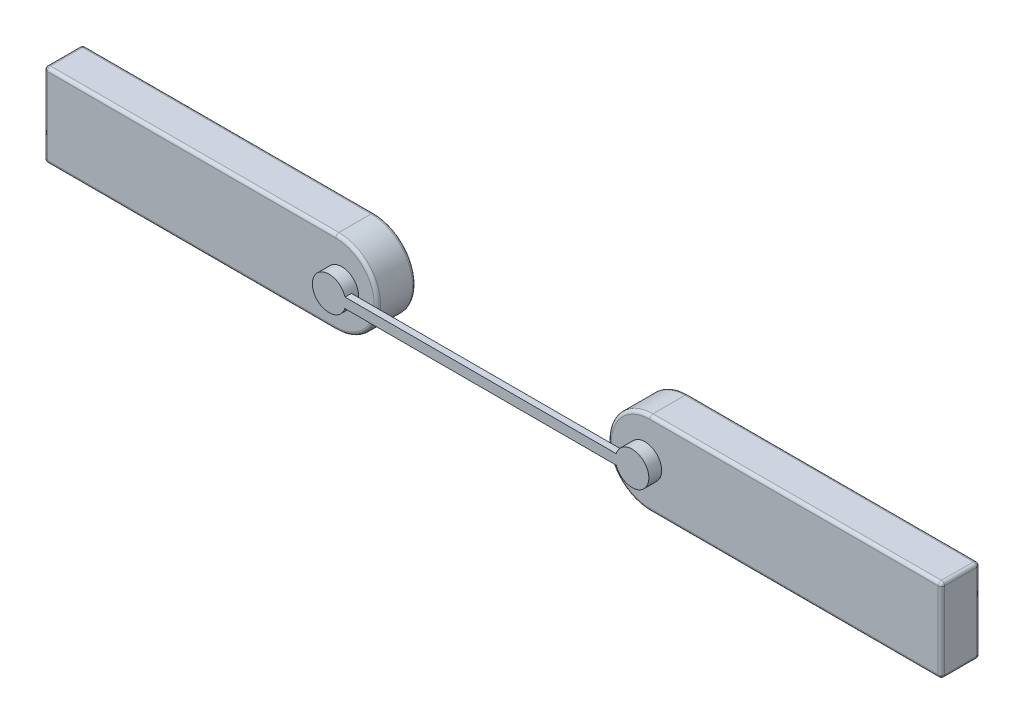
ISO-10303-21;
HEADER;
FILE_DESCRIPTION(('STEP AP214'),'2;1');
FILE_NAME('part.step','',(''),(''),'','','');
FILE_SCHEMA(('AUTOMOTIVE_DESIGN { 1 0 10303 214 1 1 1 1 }'));
ENDSEC;
DATA;
#1=APPLICATION_CONTEXT('core data for automotive mechanical design processes');
#2=APPLICATION_PROTOCOL_DEFINITION('international standard','automotive_design',2000,#1);
#3=PRODUCT_CONTEXT('',#1,'mechanical');
#4=PRODUCT('Part','Part','',(#3));
#5=PRODUCT_RELATED_PRODUCT_CATEGORY('part','',(#4));
#6=PRODUCT_DEFINITION_FORMATION('','',#4);
#7=PRODUCT_DEFINITION_CONTEXT('part definition',#1,'design');
#8=PRODUCT_DEFINITION('design','',#6,#7);
#9=PRODUCT_DEFINITION_SHAPE('','',#8);
#10=(LENGTH_UNIT() NAMED_UNIT(*) SI_UNIT(.MILLI.,.METRE.));
#11=(NAMED_UNIT(*) PLANE_ANGLE_UNIT() SI_UNIT($,.RADIAN.));
#12=(NAMED_UNIT(*) SI_UNIT($,.STERADIAN.) SOLID_ANGLE_UNIT());
#13=UNCERTAINTY_MEASURE_WITH_UNIT(LENGTH_MEASURE(1.E-05),#10,'distance_accuracy_value','');
#14=(GEOMETRIC_REPRESENTATION_CONTEXT(3) GLOBAL_UNCERTAINTY_ASSIGNED_CONTEXT((#13)) GLOBAL_UNIT_ASSIGNED_CONTEXT((#10,
#11,#12)) REPRESENTATION_CONTEXT('',''));
#15=CARTESIAN_POINT('',(0.,0.,0.));
#16=DIRECTION('',(0.,0.,1.));
#17=DIRECTION('',(1.,0.,0.));
#18=AXIS2_PLACEMENT_3D('',#15,#16,#17);
#19=CARTESIAN_POINT('',(3.475,-0.299999999999999,0.025));
#20=DIRECTION('',(1.,0.,0.));
#21=DIRECTION('',(0.,-1.,0.));
#22=AXIS2_PLACEMENT_3D('',#19,#20,#21);
#23=SPHERICAL_SURFACE('',#22,0.0250000000000006);
#24=CARTESIAN_POINT('',(3.475,-0.3,0.025));
#25=DIRECTION('',(1.,0.,0.));
#26=DIRECTION('',(0.,1.,0.));
#27=AXIS2_PLACEMENT_3D('',#24,#25,#26);
#28=CIRCLE('',#27,0.025);
#29=CARTESIAN_POINT('',(3.475,-0.3,0.));
#30=VERTEX_POINT('',#29);
#31=CARTESIAN_POINT('',(3.475,-0.325,0.025));
#32=VERTEX_POINT('',#31);
#33=EDGE_CURVE('E191',#30,#32,#28,.F.);
#34=ORIENTED_EDGE('',*,*,#33,.F.);
#35=CARTESIAN_POINT('',(3.475,-0.3,0.025));
#36=DIRECTION('',(0.,1.,0.));
#37=DIRECTION('',(0.,0.,1.));
#38=AXIS2_PLACEMENT_3D('',#35,#36,#37);
#39=CIRCLE('',#38,0.025);
#40=CARTESIAN_POINT('',(3.5,-0.3,0.025));
#41=VERTEX_POINT('',#40);
#42=EDGE_CURVE('E228',#41,#30,#39,.T.);
#43=ORIENTED_EDGE('',*,*,#42,.F.);
#44=CARTESIAN_POINT('',(3.475,-0.3,0.025));
#45=DIRECTION('',(0.,0.,-1.));
#46=DIRECTION('',(-1.,0.,0.));
#47=AXIS2_PLACEMENT_3D('',#44,#45,#46);
#48=CIRCLE('',#47,0.0249999999999998);
#49=EDGE_CURVE('E226',#32,#41,#48,.F.);
#50=ORIENTED_EDGE('',*,*,#49,.F.);
#51=EDGE_LOOP('',(#34,#43,#50));
#52=FACE_BOUND('',#51,.T.);
#53=ADVANCED_FACE('F16',(#52),#23,.T.);
#54=CARTESIAN_POINT('',(2.26404410227311,0.,0.));
#55=DIRECTION('',(0.,0.,1.));
#56=DIRECTION('',(1.,0.,0.));
#57=AXIS2_PLACEMENT_3D('',#54,#55,#56);
#58=PLANE('',#57);
#59=DIRECTION('',(0.,1.,0.));
#60=VECTOR('',#59,1.);
#61=CARTESIAN_POINT('',(3.475,0.0812500000000004,0.));
#62=LINE('',#61,#60);
#63=CARTESIAN_POINT('',(3.475,0.3,0.));
#64=VERTEX_POINT('',#63);
#65=EDGE_CURVE('E188',#30,#64,#62,.T.);
#66=ORIENTED_EDGE('',*,*,#65,.F.);
#67=DIRECTION('',(1.,0.,0.));
#68=VECTOR('',#67,1.);
#69=CARTESIAN_POINT('',(2.31327205113655,-0.3,0.));
#70=LINE('',#69,#68);
#71=CARTESIAN_POINT('',(1.225,-0.3,0.));
#72=VERTEX_POINT('',#71);
#73=EDGE_CURVE('E185',#72,#30,#70,.T.);
#74=ORIENTED_EDGE('',*,*,#73,.F.);
#75=CARTESIAN_POINT('',(1.225,0.,0.));
#76=DIRECTION('',(0.,0.,1.));
#77=DIRECTION('',(1.,0.,0.));
#78=AXIS2_PLACEMENT_3D('',#75,#76,#77);
#79=CIRCLE('',#78,0.3);
#80=CARTESIAN_POINT('',(1.225,0.3,0.));
#81=VERTEX_POINT('',#80);
#82=EDGE_CURVE('E20',#81,#72,#79,.T.);
#83=ORIENTED_EDGE('',*,*,#82,.F.);
#84=DIRECTION('',(-1.,0.,0.));
#85=VECTOR('',#84,1.);
#86=CARTESIAN_POINT('',(2.31327205113655,0.3,0.));
#87=LINE('',#86,#85);
#88=EDGE_CURVE('E201',#64,#81,#87,.T.);
#89=ORIENTED_EDGE('',*,*,#88,.F.);
#90=EDGE_LOOP('',(#66,#74,#83,#89));
#91=FACE_BOUND('',#90,.T.);
#92=ADVANCED_FACE('F187',(#91),#58,.F.);
#93=CARTESIAN_POINT('',(3.475,0.3,0.0250000000000007));
#94=DIRECTION('',(1.,0.,0.));
#95=DIRECTION('',(0.,0.,-1.));
#96=AXIS2_PLACEMENT_3D('',#93,#94,#95);
#97=SPHERICAL_SURFACE('',#96,0.0250000000000003);
#98=CARTESIAN_POINT('',(3.475,0.3,0.025));
#99=DIRECTION('',(0.,1.,0.));
#100=DIRECTION('',(0.,0.,1.));
#101=AXIS2_PLACEMENT_3D('',#98,#99,#100);
#102=CIRCLE('',#101,0.025);
#103=CARTESIAN_POINT('',(3.5,0.3,0.025));
#104=VERTEX_POINT('',#103);
#105=EDGE_CURVE('E223',#64,#104,#102,.F.);
#106=ORIENTED_EDGE('',*,*,#105,.F.);
#107=CARTESIAN_POINT('',(3.475,0.3,0.025));
#108=DIRECTION('',(-1.,0.,0.));
#109=DIRECTION('',(0.,-1.,0.));
#110=AXIS2_PLACEMENT_3D('',#107,#108,#109);
#111=CIRCLE('',#110,0.025);
#112=CARTESIAN_POINT('',(3.475,0.325,0.025));
#113=VERTEX_POINT('',#112);
#114=EDGE_CURVE('E220',#113,#64,#111,.T.);
#115=ORIENTED_EDGE('',*,*,#114,.F.);
#116=CARTESIAN_POINT('',(3.475,0.3,0.025));
#117=DIRECTION('',(0.,0.,-1.));
#118=DIRECTION('',(-1.,0.,0.));
#119=AXIS2_PLACEMENT_3D('',#116,#117,#118);
#120=CIRCLE('',#119,0.0249999999999998);
#121=EDGE_CURVE('E198',#104,#113,#120,.F.);
#122=ORIENTED_EDGE('',*,*,#121,.F.);
#123=EDGE_LOOP('',(#106,#115,#122));
#124=FACE_BOUND('',#123,.T.);
#125=ADVANCED_FACE('F402',(#124),#97,.T.);
#126=CARTESIAN_POINT('',(2.31327205113655,-0.3,0.025));
#127=DIRECTION('',(1.,0.,0.));
#128=DIRECTION('',(0.,1.,0.));
#129=AXIS2_PLACEMENT_3D('',#126,#127,#128);
#130=CYLINDRICAL_SURFACE('',#129,0.025);
#131=ORIENTED_EDGE('',*,*,#33,.T.);
#132=DIRECTION('',(1.,0.,0.));
#133=VECTOR('',#132,1.);
#134=CARTESIAN_POINT('',(2.3625,-0.325,0.025));
#135=LINE('',#134,#133);
#136=CARTESIAN_POINT('',(1.225,-0.325,0.025));
#137=VERTEX_POINT('',#136);
#138=EDGE_CURVE('E196',#137,#32,#135,.T.);
#139=ORIENTED_EDGE('',*,*,#138,.F.);
#140=CARTESIAN_POINT('',(1.225,-0.3,0.0250000000000002));
#141=DIRECTION('',(-1.,0.,0.));
#142=DIRECTION('',(0.,0.,1.));
#143=AXIS2_PLACEMENT_3D('',#140,#141,#142);
#144=CIRCLE('',#143,0.0250000000000001);
#145=EDGE_CURVE('E181',#72,#137,#144,.T.);
#146=ORIENTED_EDGE('',*,*,#145,.F.);
#147=ORIENTED_EDGE('',*,*,#73,.T.);
#148=EDGE_LOOP('',(#131,#139,#146,#147));
#149=FACE_BOUND('',#148,.T.);
#150=ADVANCED_FACE('F194',(#149),#130,.T.);
#151=CARTESIAN_POINT('',(3.475,-0.3,0.3));
#152=DIRECTION('',(0.,0.,-1.));
#153=DIRECTION('',(-1.,0.,0.));
#154=AXIS2_PLACEMENT_3D('',#151,#152,#153);
#155=CYLINDRICAL_SURFACE('',#154,0.0249999999999998);
#156=ORIENTED_EDGE('',*,*,#49,.T.);
#157=DIRECTION('',(0.,0.,-1.));
#158=VECTOR('',#157,1.);
#159=CARTESIAN_POINT('',(3.5,-0.3,0.3));
#160=LINE('',#159,#158);
#161=CARTESIAN_POINT('',(3.5,-0.300000000000008,0.275));
#162=VERTEX_POINT('',#161);
#163=EDGE_CURVE('E237',#162,#41,#160,.T.);
#164=ORIENTED_EDGE('',*,*,#163,.F.);
#165=CARTESIAN_POINT('',(3.475,-0.299999999999999,0.275));
#166=DIRECTION('',(0.,0.,1.));
#167=DIRECTION('',(0.,-1.,0.));
#168=AXIS2_PLACEMENT_3D('',#165,#166,#167);
#169=CIRCLE('',#168,0.0250000000000003);
#170=CARTESIAN_POINT('',(3.475,-0.325,0.275));
#171=VERTEX_POINT('',#170);
#172=EDGE_CURVE('E371',#171,#162,#169,.T.);
#173=ORIENTED_EDGE('',*,*,#172,.F.);
#174=DIRECTION('',(0.,0.,1.));
#175=VECTOR('',#174,1.);
#176=CARTESIAN_POINT('',(3.475,-0.325,0.3));
#177=LINE('',#176,#175);
#178=EDGE_CURVE('E379',#32,#171,#177,.T.);
#179=ORIENTED_EDGE('',*,*,#178,.F.);
#180=EDGE_LOOP('',(#156,#164,#173,#179));
#181=FACE_BOUND('',#180,.T.);
#182=ADVANCED_FACE('F776',(#181),#155,.T.);
#183=CARTESIAN_POINT('',(3.475,0.0812500000000004,0.025));
#184=DIRECTION('',(0.,1.,0.));
#185=DIRECTION('',(0.,0.,1.));
#186=AXIS2_PLACEMENT_3D('',#183,#184,#185);
#187=CYLINDRICAL_SURFACE('',#186,0.025);
#188=ORIENTED_EDGE('',*,*,#105,.T.);
#189=DIRECTION('',(0.,1.,0.));
#190=VECTOR('',#189,1.);
#191=CARTESIAN_POINT('',(3.5,0.1625,0.025));
#192=LINE('',#191,#190);
#193=EDGE_CURVE('E234',#41,#104,#192,.T.);
#194=ORIENTED_EDGE('',*,*,#193,.F.);
#195=ORIENTED_EDGE('',*,*,#42,.T.);
#196=ORIENTED_EDGE('',*,*,#65,.T.);
#197=EDGE_LOOP('',(#188,#194,#195,#196));
#198=FACE_BOUND('',#197,.T.);
#199=ADVANCED_FACE('F405',(#198),#187,.T.);
#200=CARTESIAN_POINT('',(2.31327205113655,0.3,0.025));
#201=DIRECTION('',(-1.,0.,0.));
#202=DIRECTION('',(0.,-1.,0.));
#203=AXIS2_PLACEMENT_3D('',#200,#201,#202);
#204=CYLINDRICAL_SURFACE('',#203,0.025);
#205=CARTESIAN_POINT('',(1.225,0.3,0.025));
#206=DIRECTION('',(-1.,0.,0.));
#207=DIRECTION('',(0.,0.,1.));
#208=AXIS2_PLACEMENT_3D('',#205,#206,#207);
#209=CIRCLE('',#208,0.025);
#210=CARTESIAN_POINT('',(1.225,0.325,0.025));
#211=VERTEX_POINT('',#210);
#212=EDGE_CURVE('E184',#211,#81,#209,.T.);
#213=ORIENTED_EDGE('',*,*,#212,.F.);
#214=DIRECTION('',(-1.,0.,0.));
#215=VECTOR('',#214,1.);
#216=CARTESIAN_POINT('',(2.3625,0.325,0.025));
#217=LINE('',#216,#215);
#218=EDGE_CURVE('E211',#113,#211,#217,.T.);
#219=ORIENTED_EDGE('',*,*,#218,.F.);
#220=ORIENTED_EDGE('',*,*,#114,.T.);
#221=ORIENTED_EDGE('',*,*,#88,.T.);
#222=EDGE_LOOP('',(#213,#219,#220,#221));
#223=FACE_BOUND('',#222,.T.);
#224=ADVANCED_FACE('F397',(#223),#204,.T.);
#225=CARTESIAN_POINT('',(3.475,0.3,0.3));
#226=DIRECTION('',(0.,0.,-1.));
#227=DIRECTION('',(-1.,0.,0.));
#228=AXIS2_PLACEMENT_3D('',#225,#226,#227);
#229=CYLINDRICAL_SURFACE('',#228,0.0249999999999998);
#230=ORIENTED_EDGE('',*,*,#121,.T.);
#231=DIRECTION('',(0.,0.,1.));
#232=VECTOR('',#231,1.);
#233=CARTESIAN_POINT('',(3.475,0.325,0.3));
#234=LINE('',#233,#232);
#235=CARTESIAN_POINT('',(3.475,0.325,0.275));
#236=VERTEX_POINT('',#235);
#237=EDGE_CURVE('E214',#236,#113,#234,.F.);
#238=ORIENTED_EDGE('',*,*,#237,.F.);
#239=CARTESIAN_POINT('',(3.475,0.299999999999999,0.275));
#240=DIRECTION('',(0.,0.,1.));
#241=DIRECTION('',(1.,0.,0.));
#242=AXIS2_PLACEMENT_3D('',#239,#240,#241);
#243=CIRCLE('',#242,0.0250000000000006);
#244=CARTESIAN_POINT('',(3.5,0.3,0.275));
#245=VERTEX_POINT('',#244);
#246=EDGE_CURVE('E215',#245,#236,#243,.T.);
#247=ORIENTED_EDGE('',*,*,#246,.F.);
#248=DIRECTION('',(0.,0.,-1.));
#249=VECTOR('',#248,1.);
#250=CARTESIAN_POINT('',(3.5,0.3,0.3));
#251=LINE('',#250,#249);
#252=EDGE_CURVE('E369',#104,#245,#251,.F.);
#253=ORIENTED_EDGE('',*,*,#252,.F.);
#254=EDGE_LOOP('',(#230,#238,#247,#253));
#255=FACE_BOUND('',#254,.T.);
#256=ADVANCED_FACE('F767',(#255),#229,.T.);
#257=CARTESIAN_POINT('',(1.225,0.,0.025));
#258=DIRECTION('',(0.,0.,1.));
#259=DIRECTION('',(1.,0.,0.));
#260=AXIS2_PLACEMENT_3D('',#257,#258,#259);
#261=TOROIDAL_SURFACE('',#260,0.3,0.025);
#262=ORIENTED_EDGE('',*,*,#212,.T.);
#263=ORIENTED_EDGE('',*,*,#82,.T.);
#264=ORIENTED_EDGE('',*,*,#145,.T.);
#265=CARTESIAN_POINT('',(1.225,0.,0.025));
#266=DIRECTION('',(0.,0.,-1.));
#267=DIRECTION('',(-1.,0.,0.));
#268=AXIS2_PLACEMENT_3D('',#265,#266,#267);
#269=CIRCLE('',#268,0.325);
#270=EDGE_CURVE('E344',#211,#137,#269,.F.);
#271=ORIENTED_EDGE('',*,*,#270,.F.);
#272=EDGE_LOOP('',(#262,#263,#264,#271));
#273=FACE_BOUND('',#272,.T.);
#274=ADVANCED_FACE('F179',(#273),#261,.T.);
#275=CARTESIAN_POINT('',(2.3625,-0.325,0.3));
#276=DIRECTION('',(0.,-1.,0.));
#277=DIRECTION('',(1.,0.,0.));
#278=AXIS2_PLACEMENT_3D('',#275,#276,#277);
#279=PLANE('',#278);
#280=DIRECTION('',(1.,0.,0.));
#281=VECTOR('',#280,1.);
#282=CARTESIAN_POINT('',(2.31327205113655,-0.325,0.275));
#283=LINE('',#282,#281);
#284=CARTESIAN_POINT('',(1.225,-0.325,0.275));
#285=VERTEX_POINT('',#284);
#286=EDGE_CURVE('E329',#285,#171,#283,.T.);
#287=ORIENTED_EDGE('',*,*,#286,.F.);
#288=DIRECTION('',(0.,0.,-1.));
#289=VECTOR('',#288,1.);
#290=CARTESIAN_POINT('',(1.225,-0.325,0.3));
#291=LINE('',#290,#289);
#292=EDGE_CURVE('E334',#137,#285,#291,.F.);
#293=ORIENTED_EDGE('',*,*,#292,.F.);
#294=ORIENTED_EDGE('',*,*,#138,.T.);
#295=ORIENTED_EDGE('',*,*,#178,.T.);
#296=EDGE_LOOP('',(#287,#293,#294,#295));
#297=FACE_BOUND('',#296,.T.);
#298=ADVANCED_FACE('F412',(#297),#279,.T.);
#299=CARTESIAN_POINT('',(3.475,-0.3,0.274999999999999));
#300=DIRECTION('',(1.,0.,0.));
#301=DIRECTION('',(0.,0.,-1.));
#302=AXIS2_PLACEMENT_3D('',#299,#300,#301);
#303=SPHERICAL_SURFACE('',#302,0.0250000000000003);
#304=ORIENTED_EDGE('',*,*,#172,.T.);
#305=CARTESIAN_POINT('',(3.475,-0.300000000000016,0.275));
#306=DIRECTION('',(0.,1.,0.));
#307=DIRECTION('',(0.,0.,1.));
#308=AXIS2_PLACEMENT_3D('',#305,#306,#307);
#309=CIRCLE('',#308,0.025);
#310=CARTESIAN_POINT('',(3.475,-0.300000000000008,0.3));
#311=VERTEX_POINT('',#310);
#312=EDGE_CURVE('E326',#311,#162,#309,.T.);
#313=ORIENTED_EDGE('',*,*,#312,.F.);
#314=CARTESIAN_POINT('',(3.475,-0.3,0.275));
#315=DIRECTION('',(1.,0.,0.));
#316=DIRECTION('',(0.,1.,0.));
#317=AXIS2_PLACEMENT_3D('',#314,#315,#316);
#318=CIRCLE('',#317,0.025);
#319=EDGE_CURVE('E332',#171,#311,#318,.F.);
#320=ORIENTED_EDGE('',*,*,#319,.F.);
#321=EDGE_LOOP('',(#304,#313,#320));
#322=FACE_BOUND('',#321,.T.);
#323=ADVANCED_FACE('F425',(#322),#303,.T.);
#324=CARTESIAN_POINT('',(3.5,0.1625,0.3));
#325=DIRECTION('',(1.,0.,0.));
#326=DIRECTION('',(0.,0.,-1.));
#327=AXIS2_PLACEMENT_3D('',#324,#325,#326);
#328=PLANE('',#327);
#329=ORIENTED_EDGE('',*,*,#163,.T.);
#330=ORIENTED_EDGE('',*,*,#193,.T.);
#331=ORIENTED_EDGE('',*,*,#252,.T.);
#332=DIRECTION('',(0.,1.,0.));
#333=VECTOR('',#332,1.);
#334=CARTESIAN_POINT('',(3.5,0.0812500000000004,0.275));
#335=LINE('',#334,#333);
#336=EDGE_CURVE('E323',#162,#245,#335,.T.);
#337=ORIENTED_EDGE('',*,*,#336,.F.);
#338=EDGE_LOOP('',(#329,#330,#331,#337));
#339=FACE_BOUND('',#338,.T.);
#340=ADVANCED_FACE('F762',(#339),#328,.T.);
#341=CARTESIAN_POINT('',(3.475,0.299999999999999,0.275));
#342=DIRECTION('',(1.,0.,0.));
#343=DIRECTION('',(0.,-1.,0.));
#344=AXIS2_PLACEMENT_3D('',#341,#342,#343);
#345=SPHERICAL_SURFACE('',#344,0.0250000000000006);
#346=CARTESIAN_POINT('',(3.475,0.3,0.275));
#347=DIRECTION('',(0.,1.,0.));
#348=DIRECTION('',(0.,0.,1.));
#349=AXIS2_PLACEMENT_3D('',#346,#347,#348);
#350=CIRCLE('',#349,0.025);
#351=CARTESIAN_POINT('',(3.475,0.3,0.3));
#352=VERTEX_POINT('',#351);
#353=EDGE_CURVE('E317',#245,#352,#350,.F.);
#354=ORIENTED_EDGE('',*,*,#353,.F.);
#355=ORIENTED_EDGE('',*,*,#246,.T.);
#356=CARTESIAN_POINT('',(3.475,0.3,0.275));
#357=DIRECTION('',(-1.,0.,0.));
#358=DIRECTION('',(0.,-1.,0.));
#359=AXIS2_PLACEMENT_3D('',#356,#357,#358);
#360=CIRCLE('',#359,0.025);
#361=EDGE_CURVE('E314',#352,#236,#360,.T.);
#362=ORIENTED_EDGE('',*,*,#361,.F.);
#363=EDGE_LOOP('',(#354,#355,#362));
#364=FACE_BOUND('',#363,.T.);
#365=ADVANCED_FACE('F433',(#364),#345,.T.);
#366=CARTESIAN_POINT('',(2.3625,0.325,0.3));
#367=DIRECTION('',(0.,1.,0.));
#368=DIRECTION('',(-1.,0.,0.));
#369=AXIS2_PLACEMENT_3D('',#366,#367,#368);
#370=PLANE('',#369);
#371=DIRECTION('',(-1.,0.,0.));
#372=VECTOR('',#371,1.);
#373=CARTESIAN_POINT('',(2.31327205113655,0.325,0.275));
#374=LINE('',#373,#372);
#375=CARTESIAN_POINT('',(1.225,0.325,0.275));
#376=VERTEX_POINT('',#375);
#377=EDGE_CURVE('E307',#236,#376,#374,.T.);
#378=ORIENTED_EDGE('',*,*,#377,.F.);
#379=ORIENTED_EDGE('',*,*,#237,.T.);
#380=ORIENTED_EDGE('',*,*,#218,.T.);
#381=DIRECTION('',(0.,0.,-1.));
#382=VECTOR('',#381,1.);
#383=CARTESIAN_POINT('',(1.225,0.325,0.3));
#384=LINE('',#383,#382);
#385=EDGE_CURVE('E341',#376,#211,#384,.T.);
#386=ORIENTED_EDGE('',*,*,#385,.F.);
#387=EDGE_LOOP('',(#378,#379,#380,#386));
#388=FACE_BOUND('',#387,.T.);
#389=ADVANCED_FACE('F394',(#388),#370,.T.);
#390=CARTESIAN_POINT('',(1.225,0.,0.3));
#391=DIRECTION('',(0.,0.,-1.));
#392=DIRECTION('',(-1.,0.,0.));
#393=AXIS2_PLACEMENT_3D('',#390,#391,#392);
#394=CYLINDRICAL_SURFACE('',#393,0.325);
#395=ORIENTED_EDGE('',*,*,#270,.T.);
#396=ORIENTED_EDGE('',*,*,#292,.T.);
#397=CARTESIAN_POINT('',(1.225,0.,0.275));
#398=DIRECTION('',(0.,0.,1.));
#399=DIRECTION('',(1.,0.,0.));
#400=AXIS2_PLACEMENT_3D('',#397,#398,#399);
#401=CIRCLE('',#400,0.325);
#402=EDGE_CURVE('E301',#376,#285,#401,.T.);
#403=ORIENTED_EDGE('',*,*,#402,.F.);
#404=ORIENTED_EDGE('',*,*,#385,.T.);
#405=EDGE_LOOP('',(#395,#396,#403,#404));
#406=FACE_BOUND('',#405,.T.);
#407=ADVANCED_FACE('F388',(#406),#394,.T.);
#408=CARTESIAN_POINT('',(2.31327205113655,-0.3,0.275));
#409=DIRECTION('',(1.,0.,0.));
#410=DIRECTION('',(0.,1.,0.));
#411=AXIS2_PLACEMENT_3D('',#408,#409,#410);
#412=CYLINDRICAL_SURFACE('',#411,0.025);
#413=CARTESIAN_POINT('',(1.225,-0.3,0.275));
#414=DIRECTION('',(-1.,0.,0.));
#415=DIRECTION('',(0.,-1.,0.));
#416=AXIS2_PLACEMENT_3D('',#413,#414,#415);
#417=CIRCLE('',#416,0.025);
#418=CARTESIAN_POINT('',(1.225,-0.3,0.3));
#419=VERTEX_POINT('',#418);
#420=EDGE_CURVE('E304',#285,#419,#417,.T.);
#421=ORIENTED_EDGE('',*,*,#420,.F.);
#422=ORIENTED_EDGE('',*,*,#286,.T.);
#423=ORIENTED_EDGE('',*,*,#319,.T.);
#424=DIRECTION('',(1.,0.,0.));
#425=VECTOR('',#424,1.);
#426=CARTESIAN_POINT('',(2.26404410227311,-0.3,0.3));
#427=LINE('',#426,#425);
#428=EDGE_CURVE('E293',#419,#311,#427,.T.);
#429=ORIENTED_EDGE('',*,*,#428,.F.);
#430=EDGE_LOOP('',(#421,#422,#423,#429));
#431=FACE_BOUND('',#430,.T.);
#432=ADVANCED_FACE('F419',(#431),#412,.T.);
#433=CARTESIAN_POINT('',(3.475,0.0812500000000004,0.275));
#434=DIRECTION('',(0.,1.,0.));
#435=DIRECTION('',(0.,0.,1.));
#436=AXIS2_PLACEMENT_3D('',#433,#434,#435);
#437=CYLINDRICAL_SURFACE('',#436,0.025);
#438=ORIENTED_EDGE('',*,*,#353,.T.);
#439=DIRECTION('',(0.,1.,0.));
#440=VECTOR('',#439,1.);
#441=CARTESIAN_POINT('',(3.475,0.,0.3));
#442=LINE('',#441,#440);
#443=EDGE_CURVE('E288',#311,#352,#442,.T.);
#444=ORIENTED_EDGE('',*,*,#443,.F.);
#445=ORIENTED_EDGE('',*,*,#312,.T.);
#446=ORIENTED_EDGE('',*,*,#336,.T.);
#447=EDGE_LOOP('',(#438,#444,#445,#446));
#448=FACE_BOUND('',#447,.T.);
#449=ADVANCED_FACE('F428',(#448),#437,.T.);
#450=CARTESIAN_POINT('',(2.31327205113655,0.3,0.275));
#451=DIRECTION('',(-1.,0.,0.));
#452=DIRECTION('',(0.,-1.,0.));
#453=AXIS2_PLACEMENT_3D('',#450,#451,#452);
#454=CYLINDRICAL_SURFACE('',#453,0.025);
#455=CARTESIAN_POINT('',(1.225,0.3,0.275));
#456=DIRECTION('',(-1.,0.,0.));
#457=DIRECTION('',(0.,0.,1.));
#458=AXIS2_PLACEMENT_3D('',#455,#456,#457);
#459=CIRCLE('',#458,0.0250000000000001);
#460=CARTESIAN_POINT('',(1.225,0.3,0.3));
#461=VERTEX_POINT('',#460);
#462=EDGE_CURVE('E306',#461,#376,#459,.T.);
#463=ORIENTED_EDGE('',*,*,#462,.F.);
#464=DIRECTION('',(1.,0.,0.));
#465=VECTOR('',#464,1.);
#466=CARTESIAN_POINT('',(2.26404410227311,0.3,0.3));
#467=LINE('',#466,#465);
#468=EDGE_CURVE('E283',#352,#461,#467,.F.);
#469=ORIENTED_EDGE('',*,*,#468,.F.);
#470=ORIENTED_EDGE('',*,*,#361,.T.);
#471=ORIENTED_EDGE('',*,*,#377,.T.);
#472=EDGE_LOOP('',(#463,#469,#470,#471));
#473=FACE_BOUND('',#472,.T.);
#474=ADVANCED_FACE('F435',(#473),#454,.T.);
#475=CARTESIAN_POINT('',(1.225,0.,0.275));
#476=DIRECTION('',(0.,0.,-1.));
#477=DIRECTION('',(-1.,0.,0.));
#478=AXIS2_PLACEMENT_3D('',#475,#476,#477);
#479=TOROIDAL_SURFACE('',#478,0.3,0.025);
#480=ORIENTED_EDGE('',*,*,#462,.T.);
#481=ORIENTED_EDGE('',*,*,#402,.T.);
#482=ORIENTED_EDGE('',*,*,#420,.T.);
#483=CARTESIAN_POINT('',(1.225,0.,0.3));
#484=DIRECTION('',(0.,0.,-1.));
#485=DIRECTION('',(-1.,0.,0.));
#486=AXIS2_PLACEMENT_3D('',#483,#484,#485);
#487=CIRCLE('',#486,0.3);
#488=EDGE_CURVE('E281',#461,#419,#487,.F.);
#489=ORIENTED_EDGE('',*,*,#488,.F.);
#490=EDGE_LOOP('',(#480,#481,#482,#489));
#491=FACE_BOUND('',#490,.T.);
#492=ADVANCED_FACE('F418',(#491),#479,.T.);
#493=CARTESIAN_POINT('',(2.26404410227311,0.,0.3));
#494=DIRECTION('',(0.,0.,1.));
#495=DIRECTION('',(1.,0.,0.));
#496=AXIS2_PLACEMENT_3D('',#493,#494,#495);
#497=PLANE('',#496);
#498=CARTESIAN_POINT('',(1.187218344912,0.,0.3));
#499=DIRECTION('',(0.,0.,1.));
#500=DIRECTION('',(0.,-1.,0.));
#501=AXIS2_PLACEMENT_3D('',#498,#499,#500);
#502=CIRCLE('',#501,0.130095375642435);
#503=CARTESIAN_POINT('',(1.187218344912,-0.130095375642435,0.3));
#504=VERTEX_POINT('',#503);
#505=EDGE_CURVE('E274',#504,#504,#502,.T.);
#506=ORIENTED_EDGE('',*,*,#505,.F.);
#507=EDGE_LOOP('',(#506));
#508=FACE_BOUND('',#507,.T.);
#509=ORIENTED_EDGE('',*,*,#468,.T.);
#510=ORIENTED_EDGE('',*,*,#488,.T.);
#511=ORIENTED_EDGE('',*,*,#428,.T.);
#512=ORIENTED_EDGE('',*,*,#443,.T.);
#513=EDGE_LOOP('',(#509,#510,#511,#512));
#514=FACE_BOUND('',#513,.T.);
#515=ADVANCED_FACE('F421',(#508,#514),#497,.T.);
#516=CARTESIAN_POINT('',(-0.00188594796703023,-0.00170824081486831,0.35));
#517=DIRECTION('',(0.,0.,1.));
#518=DIRECTION('',(1.,0.,0.));
#519=AXIS2_PLACEMENT_3D('',#516,#517,#518);
#520=PLANE('',#519);
#521=CARTESIAN_POINT('',(1.187218344912,0.,0.35));
#522=DIRECTION('',(0.,0.,1.));
#523=DIRECTION('',(0.,-1.,0.));
#524=AXIS2_PLACEMENT_3D('',#521,#522,#523);
#525=CIRCLE('',#524,0.130095375642435);
#526=CARTESIAN_POINT('',(1.06361107278189,-0.0405715299206016,0.35));
#527=VERTEX_POINT('',#526);
#528=CARTESIAN_POINT('',(1.06254152609611,0.0371550482908656,0.35));
#529=VERTEX_POINT('',#528);
#530=EDGE_CURVE('E270',#527,#529,#525,.F.);
#531=ORIENTED_EDGE('',*,*,#530,.F.);
#532=DIRECTION('',(1.,0.,0.));
#533=VECTOR('',#532,1.);
#534=CARTESIAN_POINT('',(-0.00188594796703023,-0.0405715299206022,0.35));
#535=LINE('',#534,#533);
#536=CARTESIAN_POINT('',(-1.05394264045783,-0.0405715299206022,0.35));
#537=VERTEX_POINT('',#536);
#538=EDGE_CURVE('E277',#537,#527,#535,.T.);
#539=ORIENTED_EDGE('',*,*,#538,.F.);
#540=CARTESIAN_POINT('',(-1.17754991258794,0.,0.35));
#541=DIRECTION('',(0.,0.,1.));
#542=DIRECTION('',(0.,-1.,0.));
#543=AXIS2_PLACEMENT_3D('',#540,#541,#542);
#544=CIRCLE('',#543,0.130095375642435);
#545=CARTESIAN_POINT('',(-1.05287309377205,0.0371550482908656,0.35));
#546=VERTEX_POINT('',#545);
#547=EDGE_CURVE('E278',#546,#537,#544,.F.);
#548=ORIENTED_EDGE('',*,*,#547,.F.);
#549=DIRECTION('',(1.,0.,0.));
#550=VECTOR('',#549,1.);
#551=CARTESIAN_POINT('',(-0.00188594796703023,0.0371550482908656,0.35));
#552=LINE('',#551,#550);
#553=EDGE_CURVE('E547',#529,#546,#552,.F.);
#554=ORIENTED_EDGE('',*,*,#553,.F.);
#555=EDGE_LOOP('',(#531,#539,#548,#554));
#556=FACE_BOUND('',#555,.T.);
#557=ADVANCED_FACE('F529',(#556),#520,.F.);
#558=CARTESIAN_POINT('',(-0.00188594796703023,-0.0405715299206022,0.4));
#559=DIRECTION('',(0.,-1.,0.));
#560=DIRECTION('',(0.,0.,-1.));
#561=AXIS2_PLACEMENT_3D('',#558,#559,#560);
#562=PLANE('',#561);
#563=DIRECTION('',(0.,0.,-1.));
#564=VECTOR('',#563,1.);
#565=CARTESIAN_POINT('',(-1.05394264045783,-0.0405715299206022,0.4));
#566=LINE('',#565,#564);
#567=CARTESIAN_POINT('',(-1.05394264045783,-0.0405715299206017,0.4));
#568=VERTEX_POINT('',#567);
#569=EDGE_CURVE('E280',#568,#537,#566,.T.);
#570=ORIENTED_EDGE('',*,*,#569,.T.);
#571=ORIENTED_EDGE('',*,*,#538,.T.);
#572=DIRECTION('',(0.,0.,1.));
#573=VECTOR('',#572,1.);
#574=CARTESIAN_POINT('',(1.06361107278189,-0.0405715299206011,0.3));
#575=LINE('',#574,#573);
#576=CARTESIAN_POINT('',(1.06361107278189,-0.0405715299206011,0.4));
#577=VERTEX_POINT('',#576);
#578=EDGE_CURVE('E273',#577,#527,#575,.F.);
#579=ORIENTED_EDGE('',*,*,#578,.F.);
#580=DIRECTION('',(1.,0.,0.));
#581=VECTOR('',#580,1.);
#582=CARTESIAN_POINT('',(-1.17754991258794,-0.0405715299206012,0.4));
#583=LINE('',#582,#581);
#584=EDGE_CURVE('E269',#568,#577,#583,.T.);
#585=ORIENTED_EDGE('',*,*,#584,.F.);
#586=EDGE_LOOP('',(#570,#571,#579,#585));
#587=FACE_BOUND('',#586,.T.);
#588=ADVANCED_FACE('F525',(#587),#562,.T.);
#589=CARTESIAN_POINT('',(1.187218344912,0.,0.3));
#590=DIRECTION('',(0.,0.,1.));
#591=DIRECTION('',(0.,-1.,0.));
#592=AXIS2_PLACEMENT_3D('',#589,#590,#591);
#593=CYLINDRICAL_SURFACE('',#592,0.130095375642435);
#594=ORIENTED_EDGE('',*,*,#505,.T.);
#595=EDGE_LOOP('',(#594));
#596=FACE_BOUND('',#595,.T.);
#597=DIRECTION('',(0.,0.,1.));
#598=VECTOR('',#597,1.);
#599=CARTESIAN_POINT('',(1.06254152609611,0.0371550482908656,0.4));
#600=LINE('',#599,#598);
#601=CARTESIAN_POINT('',(1.06254152609611,0.0371550482908656,0.4));
#602=VERTEX_POINT('',#601);
#603=EDGE_CURVE('E272',#602,#529,#600,.F.);
#604=ORIENTED_EDGE('',*,*,#603,.F.);
#605=CARTESIAN_POINT('',(1.187218344912,0.,0.4));
#606=DIRECTION('',(0.,0.,1.));
#607=DIRECTION('',(0.,-1.,0.));
#608=AXIS2_PLACEMENT_3D('',#605,#606,#607);
#609=CIRCLE('',#608,0.130095375642435);
#610=EDGE_CURVE('E267',#577,#602,#609,.T.);
#611=ORIENTED_EDGE('',*,*,#610,.F.);
#612=ORIENTED_EDGE('',*,*,#578,.T.);
#613=ORIENTED_EDGE('',*,*,#530,.T.);
#614=EDGE_LOOP('',(#604,#611,#612,#613));
#615=FACE_BOUND('',#614,.T.);
#616=ADVANCED_FACE('F521',(#596,#615),#593,.T.);
#617=CARTESIAN_POINT('',(-0.00188594796703023,0.0371550482908656,0.4));
#618=DIRECTION('',(0.,1.,0.));
#619=DIRECTION('',(0.,0.,1.));
#620=AXIS2_PLACEMENT_3D('',#617,#618,#619);
#621=PLANE('',#620);
#622=DIRECTION('',(0.,0.,1.));
#623=VECTOR('',#622,1.);
#624=CARTESIAN_POINT('',(-1.05287309377205,0.0371550482908656,0.4));
#625=LINE('',#624,#623);
#626=CARTESIAN_POINT('',(-1.05287309377205,0.0371550482908656,0.4));
#627=VERTEX_POINT('',#626);
#628=EDGE_CURVE('E552',#546,#627,#625,.T.);
#629=ORIENTED_EDGE('',*,*,#628,.T.);
#630=DIRECTION('',(1.,0.,0.));
#631=VECTOR('',#630,1.);
#632=CARTESIAN_POINT('',(-1.17754991258794,0.0371550482908656,0.4));
#633=LINE('',#632,#631);
#634=EDGE_CURVE('E266',#602,#627,#633,.F.);
#635=ORIENTED_EDGE('',*,*,#634,.F.);
#636=ORIENTED_EDGE('',*,*,#603,.T.);
#637=ORIENTED_EDGE('',*,*,#553,.T.);
#638=EDGE_LOOP('',(#629,#635,#636,#637));
#639=FACE_BOUND('',#638,.T.);
#640=ADVANCED_FACE('F517',(#639),#621,.T.);
#641=CARTESIAN_POINT('',(-1.17754991258794,0.,0.4));
#642=DIRECTION('',(0.,0.,1.));
#643=DIRECTION('',(1.,0.,0.));
#644=AXIS2_PLACEMENT_3D('',#641,#642,#643);
#645=PLANE('',#644);
#646=CARTESIAN_POINT('',(-1.17754991258794,0.,0.4));
#647=DIRECTION('',(0.,0.,1.));
#648=DIRECTION('',(0.,-1.,0.));
#649=AXIS2_PLACEMENT_3D('',#646,#647,#648);
#650=CIRCLE('',#649,0.130095375642435);
#651=EDGE_CURVE('E264',#568,#627,#650,.F.);
#652=ORIENTED_EDGE('',*,*,#651,.F.);
#653=ORIENTED_EDGE('',*,*,#584,.T.);
#654=ORIENTED_EDGE('',*,*,#610,.T.);
#655=ORIENTED_EDGE('',*,*,#634,.T.);
#656=EDGE_LOOP('',(#652,#653,#654,#655));
#657=FACE_BOUND('',#656,.T.);
#658=ADVANCED_FACE('F513',(#657),#645,.T.);
#659=CARTESIAN_POINT('',(-1.17754991258794,0.,0.3));
#660=DIRECTION('',(0.,0.,1.));
#661=DIRECTION('',(0.,-1.,0.));
#662=AXIS2_PLACEMENT_3D('',#659,#660,#661);
#663=CYLINDRICAL_SURFACE('',#662,0.130095375642435);
#664=CARTESIAN_POINT('',(-1.17754991258794,0.,0.3));
#665=DIRECTION('',(0.,0.,1.));
#666=DIRECTION('',(0.,-1.,0.));
#667=AXIS2_PLACEMENT_3D('',#664,#665,#666);
#668=CIRCLE('',#667,0.130095375642435);
#669=CARTESIAN_POINT('',(-1.17754991258794,-0.130095375642435,0.3));
#670=VERTEX_POINT('',#669);
#671=EDGE_CURVE('E261',#670,#670,#668,.F.);
#672=ORIENTED_EDGE('',*,*,#671,.F.);
#673=EDGE_LOOP('',(#672));
#674=FACE_BOUND('',#673,.T.);
#675=ORIENTED_EDGE('',*,*,#651,.T.);
#676=ORIENTED_EDGE('',*,*,#628,.F.);
#677=ORIENTED_EDGE('',*,*,#547,.T.);
#678=ORIENTED_EDGE('',*,*,#569,.F.);
#679=EDGE_LOOP('',(#675,#676,#677,#678));
#680=FACE_BOUND('',#679,.T.);
#681=ADVANCED_FACE('F510',(#674,#680),#663,.T.);
#682=CARTESIAN_POINT('',(-3.475,0.299999999999999,0.275));
#683=DIRECTION('',(1.,0.,0.));
#684=DIRECTION('',(0.,1.,0.));
#685=AXIS2_PLACEMENT_3D('',#682,#683,#684);
#686=SPHERICAL_SURFACE('',#685,0.0250000000000006);
#687=CARTESIAN_POINT('',(-3.475,0.3,0.275));
#688=DIRECTION('',(0.,0.,-1.));
#689=DIRECTION('',(-1.,0.,0.));
#690=AXIS2_PLACEMENT_3D('',#687,#688,#689);
#691=CIRCLE('',#690,0.0249999999999998);
#692=CARTESIAN_POINT('',(-3.5,0.3,0.275));
#693=VERTEX_POINT('',#692);
#694=CARTESIAN_POINT('',(-3.475,0.325,0.275));
#695=VERTEX_POINT('',#694);
#696=EDGE_CURVE('E575',#693,#695,#691,.T.);
#697=ORIENTED_EDGE('',*,*,#696,.F.);
#698=CARTESIAN_POINT('',(-3.475,0.3,0.275));
#699=DIRECTION('',(0.,-1.,0.));
#700=DIRECTION('',(0.,0.,-1.));
#701=AXIS2_PLACEMENT_3D('',#698,#699,#700);
#702=CIRCLE('',#701,0.025);
#703=CARTESIAN_POINT('',(-3.475,0.3,0.3));
#704=VERTEX_POINT('',#703);
#705=EDGE_CURVE('E591',#704,#693,#702,.T.);
#706=ORIENTED_EDGE('',*,*,#705,.F.);
#707=CARTESIAN_POINT('',(-3.475,0.3,0.275));
#708=DIRECTION('',(-1.,0.,0.));
#709=DIRECTION('',(0.,-1.,0.));
#710=AXIS2_PLACEMENT_3D('',#707,#708,#709);
#711=CIRCLE('',#710,0.025);
#712=EDGE_CURVE('E260',#695,#704,#711,.F.);
#713=ORIENTED_EDGE('',*,*,#712,.F.);
#714=EDGE_LOOP('',(#697,#706,#713));
#715=FACE_BOUND('',#714,.T.);
#716=ADVANCED_FACE('F508',(#715),#686,.T.);
#717=CARTESIAN_POINT('',(-2.26404410227311,0.,0.3));
#718=DIRECTION('',(0.,0.,1.));
#719=DIRECTION('',(1.,0.,0.));
#720=AXIS2_PLACEMENT_3D('',#717,#718,#719);
#721=PLANE('',#720);
#722=ORIENTED_EDGE('',*,*,#671,.T.);
#723=EDGE_LOOP('',(#722));
#724=FACE_BOUND('',#723,.T.);
#725=CARTESIAN_POINT('',(-1.225,0.,0.3));
#726=DIRECTION('',(0.,0.,-1.));
#727=DIRECTION('',(-1.,0.,0.));
#728=AXIS2_PLACEMENT_3D('',#725,#726,#727);
#729=CIRCLE('',#728,0.3);
#730=CARTESIAN_POINT('',(-1.225,0.3,0.3));
#731=VERTEX_POINT('',#730);
#732=CARTESIAN_POINT('',(-1.225,-0.3,0.3));
#733=VERTEX_POINT('',#732);
#734=EDGE_CURVE('E258',#731,#733,#729,.T.);
#735=ORIENTED_EDGE('',*,*,#734,.F.);
#736=DIRECTION('',(-1.,0.,0.));
#737=VECTOR('',#736,1.);
#738=CARTESIAN_POINT('',(-2.31327205113655,0.3,0.3));
#739=LINE('',#738,#737);
#740=EDGE_CURVE('E566',#704,#731,#739,.F.);
#741=ORIENTED_EDGE('',*,*,#740,.F.);
#742=DIRECTION('',(0.,-1.,0.));
#743=VECTOR('',#742,1.);
#744=CARTESIAN_POINT('',(-3.475,-0.0812499999999997,0.3));
#745=LINE('',#744,#743);
#746=CARTESIAN_POINT('',(-3.475,-0.3,0.3));
#747=VERTEX_POINT('',#746);
#748=EDGE_CURVE('E572',#747,#704,#745,.F.);
#749=ORIENTED_EDGE('',*,*,#748,.F.);
#750=DIRECTION('',(1.,0.,0.));
#751=VECTOR('',#750,1.);
#752=CARTESIAN_POINT('',(-2.31327205113655,-0.3,0.3));
#753=LINE('',#752,#751);
#754=EDGE_CURVE('E579',#733,#747,#753,.F.);
#755=ORIENTED_EDGE('',*,*,#754,.F.);
#756=EDGE_LOOP('',(#735,#741,#749,#755));
#757=FACE_BOUND('',#756,.T.);
#758=ADVANCED_FACE('F504',(#724,#757),#721,.T.);
#759=CARTESIAN_POINT('',(-3.475,-0.3,0.274999999999999));
#760=DIRECTION('',(1.,0.,0.));
#761=DIRECTION('',(0.,0.,1.));
#762=AXIS2_PLACEMENT_3D('',#759,#760,#761);
#763=SPHERICAL_SURFACE('',#762,0.0250000000000003);
#764=CARTESIAN_POINT('',(-3.475,-0.3,0.275));
#765=DIRECTION('',(0.,-1.,0.));
#766=DIRECTION('',(0.,0.,-1.));
#767=AXIS2_PLACEMENT_3D('',#764,#765,#766);
#768=CIRCLE('',#767,0.025);
#769=CARTESIAN_POINT('',(-3.5,-0.3,0.275));
#770=VERTEX_POINT('',#769);
#771=EDGE_CURVE('E576',#770,#747,#768,.F.);
#772=ORIENTED_EDGE('',*,*,#771,.F.);
#773=CARTESIAN_POINT('',(-3.475,-0.3,0.275));
#774=DIRECTION('',(0.,0.,-1.));
#775=DIRECTION('',(-1.,0.,0.));
#776=AXIS2_PLACEMENT_3D('',#773,#774,#775);
#777=CIRCLE('',#776,0.0249999999999998);
#778=CARTESIAN_POINT('',(-3.475,-0.325,0.275));
#779=VERTEX_POINT('',#778);
#780=EDGE_CURVE('E582',#779,#770,#777,.T.);
#781=ORIENTED_EDGE('',*,*,#780,.F.);
#782=CARTESIAN_POINT('',(-3.475,-0.3,0.275));
#783=DIRECTION('',(1.,0.,0.));
#784=DIRECTION('',(0.,1.,0.));
#785=AXIS2_PLACEMENT_3D('',#782,#783,#784);
#786=CIRCLE('',#785,0.025);
#787=EDGE_CURVE('E615',#747,#779,#786,.T.);
#788=ORIENTED_EDGE('',*,*,#787,.F.);
#789=EDGE_LOOP('',(#772,#781,#788));
#790=FACE_BOUND('',#789,.T.);
#791=ADVANCED_FACE('F507',(#790),#763,.T.);
#792=CARTESIAN_POINT('',(-1.225,0.,0.275));
#793=DIRECTION('',(0.,0.,-1.));
#794=DIRECTION('',(-1.,0.,0.));
#795=AXIS2_PLACEMENT_3D('',#792,#793,#794);
#796=TOROIDAL_SURFACE('',#795,0.3,0.0249999999999997);
#797=ORIENTED_EDGE('',*,*,#734,.T.);
#798=CARTESIAN_POINT('',(-1.225,-0.3,0.275));
#799=DIRECTION('',(1.,0.,0.));
#800=DIRECTION('',(0.,1.,0.));
#801=AXIS2_PLACEMENT_3D('',#798,#799,#800);
#802=CIRCLE('',#801,0.025);
#803=CARTESIAN_POINT('',(-1.225,-0.325,0.275));
#804=VERTEX_POINT('',#803);
#805=EDGE_CURVE('E583',#804,#733,#802,.F.);
#806=ORIENTED_EDGE('',*,*,#805,.F.);
#807=CARTESIAN_POINT('',(-1.225,0.,0.275));
#808=DIRECTION('',(0.,0.,-1.));
#809=DIRECTION('',(-1.,0.,0.));
#810=AXIS2_PLACEMENT_3D('',#807,#808,#809);
#811=CIRCLE('',#810,0.325);
#812=CARTESIAN_POINT('',(-1.225,0.325,0.275));
#813=VERTEX_POINT('',#812);
#814=EDGE_CURVE('E618',#813,#804,#811,.T.);
#815=ORIENTED_EDGE('',*,*,#814,.F.);
#816=CARTESIAN_POINT('',(-1.225,0.3,0.275));
#817=DIRECTION('',(-1.,0.,0.));
#818=DIRECTION('',(0.,-1.,0.));
#819=AXIS2_PLACEMENT_3D('',#816,#817,#818);
#820=CIRCLE('',#819,0.025);
#821=EDGE_CURVE('E569',#731,#813,#820,.T.);
#822=ORIENTED_EDGE('',*,*,#821,.F.);
#823=EDGE_LOOP('',(#797,#806,#815,#822));
#824=FACE_BOUND('',#823,.T.);
#825=ADVANCED_FACE('F502',(#824),#796,.T.);
#826=CARTESIAN_POINT('',(-2.31327205113655,0.3,0.275));
#827=DIRECTION('',(-1.,0.,0.));
#828=DIRECTION('',(0.,-1.,0.));
#829=AXIS2_PLACEMENT_3D('',#826,#827,#828);
#830=CYLINDRICAL_SURFACE('',#829,0.025);
#831=ORIENTED_EDGE('',*,*,#821,.T.);
#832=DIRECTION('',(-1.,0.,0.));
#833=VECTOR('',#832,1.);
#834=CARTESIAN_POINT('',(-2.3625,0.325,0.275));
#835=LINE('',#834,#833);
#836=EDGE_CURVE('E594',#695,#813,#835,.F.);
#837=ORIENTED_EDGE('',*,*,#836,.F.);
#838=ORIENTED_EDGE('',*,*,#712,.T.);
#839=ORIENTED_EDGE('',*,*,#740,.T.);
#840=EDGE_LOOP('',(#831,#837,#838,#839));
#841=FACE_BOUND('',#840,.T.);
#842=ADVANCED_FACE('F498',(#841),#830,.T.);
#843=CARTESIAN_POINT('',(-3.475,-0.0812499999999997,0.275));
#844=DIRECTION('',(0.,-1.,0.));
#845=DIRECTION('',(0.,0.,-1.));
#846=AXIS2_PLACEMENT_3D('',#843,#844,#845);
#847=CYLINDRICAL_SURFACE('',#846,0.025);
#848=ORIENTED_EDGE('',*,*,#771,.T.);
#849=ORIENTED_EDGE('',*,*,#748,.T.);
#850=ORIENTED_EDGE('',*,*,#705,.T.);
#851=DIRECTION('',(0.,1.,0.));
#852=VECTOR('',#851,1.);
#853=CARTESIAN_POINT('',(-3.5,-0.1625,0.275));
#854=LINE('',#853,#852);
#855=EDGE_CURVE('E607',#770,#693,#854,.T.);
#856=ORIENTED_EDGE('',*,*,#855,.F.);
#857=EDGE_LOOP('',(#848,#849,#850,#856));
#858=FACE_BOUND('',#857,.T.);
#859=ADVANCED_FACE('F494',(#858),#847,.T.);
#860=CARTESIAN_POINT('',(-3.475,0.3,0.3));
#861=DIRECTION('',(0.,0.,-1.));
#862=DIRECTION('',(-1.,0.,0.));
#863=AXIS2_PLACEMENT_3D('',#860,#861,#862);
#864=CYLINDRICAL_SURFACE('',#863,0.0249999999999998);
#865=CARTESIAN_POINT('',(-3.475,0.299999999999999,0.025));
#866=DIRECTION('',(0.,0.,-1.));
#867=DIRECTION('',(-1.,0.,0.));
#868=AXIS2_PLACEMENT_3D('',#865,#866,#867);
#869=CIRCLE('',#868,0.0250000000000003);
#870=CARTESIAN_POINT('',(-3.5,0.3,0.025));
#871=VERTEX_POINT('',#870);
#872=CARTESIAN_POINT('',(-3.475,0.325,0.025));
#873=VERTEX_POINT('',#872);
#874=EDGE_CURVE('E640',#871,#873,#869,.T.);
#875=ORIENTED_EDGE('',*,*,#874,.F.);
#876=DIRECTION('',(0.,0.,1.));
#877=VECTOR('',#876,1.);
#878=CARTESIAN_POINT('',(-3.5,0.3,0.3));
#879=LINE('',#878,#877);
#880=EDGE_CURVE('E610',#693,#871,#879,.F.);
#881=ORIENTED_EDGE('',*,*,#880,.F.);
#882=ORIENTED_EDGE('',*,*,#696,.T.);
#883=DIRECTION('',(0.,0.,1.));
#884=VECTOR('',#883,1.);
#885=CARTESIAN_POINT('',(-3.475,0.325,0.3));
#886=LINE('',#885,#884);
#887=EDGE_CURVE('E598',#873,#695,#886,.T.);
#888=ORIENTED_EDGE('',*,*,#887,.F.);
#889=EDGE_LOOP('',(#875,#881,#882,#888));
#890=FACE_BOUND('',#889,.T.);
#891=ADVANCED_FACE('F490',(#890),#864,.T.);
#892=CARTESIAN_POINT('',(-2.31327205113655,-0.3,0.275));
#893=DIRECTION('',(1.,0.,0.));
#894=DIRECTION('',(0.,1.,0.));
#895=AXIS2_PLACEMENT_3D('',#892,#893,#894);
#896=CYLINDRICAL_SURFACE('',#895,0.025);
#897=ORIENTED_EDGE('',*,*,#805,.T.);
#898=ORIENTED_EDGE('',*,*,#754,.T.);
#899=ORIENTED_EDGE('',*,*,#787,.T.);
#900=DIRECTION('',(1.,0.,0.));
#901=VECTOR('',#900,1.);
#902=CARTESIAN_POINT('',(-2.3625,-0.325,0.275));
#903=LINE('',#902,#901);
#904=EDGE_CURVE('E629',#804,#779,#903,.F.);
#905=ORIENTED_EDGE('',*,*,#904,.F.);
#906=EDGE_LOOP('',(#897,#898,#899,#905));
#907=FACE_BOUND('',#906,.T.);
#908=ADVANCED_FACE('F486',(#907),#896,.T.);
#909=CARTESIAN_POINT('',(-3.475,-0.3,0.3));
#910=DIRECTION('',(0.,0.,-1.));
#911=DIRECTION('',(-1.,0.,0.));
#912=AXIS2_PLACEMENT_3D('',#909,#910,#911);
#913=CYLINDRICAL_SURFACE('',#912,0.0249999999999998);
#914=CARTESIAN_POINT('',(-3.475,-0.299999999999999,0.025));
#915=DIRECTION('',(0.,0.,-1.));
#916=DIRECTION('',(0.,1.,0.));
#917=AXIS2_PLACEMENT_3D('',#914,#915,#916);
#918=CIRCLE('',#917,0.0250000000000006);
#919=CARTESIAN_POINT('',(-3.475,-0.325,0.025));
#920=VERTEX_POINT('',#919);
#921=CARTESIAN_POINT('',(-3.5,-0.3,0.025));
#922=VERTEX_POINT('',#921);
#923=EDGE_CURVE('E660',#920,#922,#918,.T.);
#924=ORIENTED_EDGE('',*,*,#923,.F.);
#925=DIRECTION('',(0.,0.,1.));
#926=VECTOR('',#925,1.);
#927=CARTESIAN_POINT('',(-3.475,-0.325,0.3));
#928=LINE('',#927,#926);
#929=EDGE_CURVE('E632',#779,#920,#928,.F.);
#930=ORIENTED_EDGE('',*,*,#929,.F.);
#931=ORIENTED_EDGE('',*,*,#780,.T.);
#932=DIRECTION('',(0.,0.,1.));
#933=VECTOR('',#932,1.);
#934=CARTESIAN_POINT('',(-3.5,-0.3,0.3));
#935=LINE('',#934,#933);
#936=EDGE_CURVE('E611',#922,#770,#935,.T.);
#937=ORIENTED_EDGE('',*,*,#936,.F.);
#938=EDGE_LOOP('',(#924,#930,#931,#937));
#939=FACE_BOUND('',#938,.T.);
#940=ADVANCED_FACE('F482',(#939),#913,.T.);
#941=CARTESIAN_POINT('',(-1.225,0.,0.3));
#942=DIRECTION('',(0.,0.,-1.));
#943=DIRECTION('',(-1.,0.,0.));
#944=AXIS2_PLACEMENT_3D('',#941,#942,#943);
#945=CYLINDRICAL_SURFACE('',#944,0.325);
#946=ORIENTED_EDGE('',*,*,#814,.T.);
#947=DIRECTION('',(0.,0.,1.));
#948=VECTOR('',#947,1.);
#949=CARTESIAN_POINT('',(-1.225,-0.325,0.3));
#950=LINE('',#949,#948);
#951=CARTESIAN_POINT('',(-1.225,-0.325,0.025));
#952=VERTEX_POINT('',#951);
#953=EDGE_CURVE('E633',#952,#804,#950,.T.);
#954=ORIENTED_EDGE('',*,*,#953,.F.);
#955=CARTESIAN_POINT('',(-1.225,0.,0.025));
#956=DIRECTION('',(0.,0.,-1.));
#957=DIRECTION('',(-1.,0.,0.));
#958=AXIS2_PLACEMENT_3D('',#955,#956,#957);
#959=CIRCLE('',#958,0.325);
#960=CARTESIAN_POINT('',(-1.225,0.325,0.025));
#961=VERTEX_POINT('',#960);
#962=EDGE_CURVE('E643',#961,#952,#959,.T.);
#963=ORIENTED_EDGE('',*,*,#962,.F.);
#964=DIRECTION('',(0.,0.,1.));
#965=VECTOR('',#964,1.);
#966=CARTESIAN_POINT('',(-1.225,0.325,0.3));
#967=LINE('',#966,#965);
#968=EDGE_CURVE('E597',#813,#961,#967,.F.);
#969=ORIENTED_EDGE('',*,*,#968,.F.);
#970=EDGE_LOOP('',(#946,#954,#963,#969));
#971=FACE_BOUND('',#970,.T.);
#972=ADVANCED_FACE('F478',(#971),#945,.T.);
#973=CARTESIAN_POINT('',(-2.3625,0.325,0.3));
#974=DIRECTION('',(0.,1.,0.));
#975=DIRECTION('',(-1.,0.,0.));
#976=AXIS2_PLACEMENT_3D('',#973,#974,#975);
#977=PLANE('',#976);
#978=ORIENTED_EDGE('',*,*,#836,.T.);
#979=ORIENTED_EDGE('',*,*,#968,.T.);
#980=DIRECTION('',(-1.,0.,0.));
#981=VECTOR('',#980,1.);
#982=CARTESIAN_POINT('',(-2.31327205113655,0.325,0.025));
#983=LINE('',#982,#981);
#984=EDGE_CURVE('E648',#873,#961,#983,.F.);
#985=ORIENTED_EDGE('',*,*,#984,.F.);
#986=ORIENTED_EDGE('',*,*,#887,.T.);
#987=EDGE_LOOP('',(#978,#979,#985,#986));
#988=FACE_BOUND('',#987,.T.);
#989=ADVANCED_FACE('F475',(#988),#977,.T.);
#990=CARTESIAN_POINT('',(-3.475,0.3,0.0250000000000007));
#991=DIRECTION('',(1.,0.,0.));
#992=DIRECTION('',(0.,0.,-1.));
#993=AXIS2_PLACEMENT_3D('',#990,#991,#992);
#994=SPHERICAL_SURFACE('',#993,0.0250000000000003);
#995=CARTESIAN_POINT('',(-3.475,0.3,0.025));
#996=DIRECTION('',(-1.,0.,0.));
#997=DIRECTION('',(0.,-1.,0.));
#998=AXIS2_PLACEMENT_3D('',#995,#996,#997);
#999=CIRCLE('',#998,0.025);
#1000=CARTESIAN_POINT('',(-3.475,0.3,0.));
#1001=VERTEX_POINT('',#1000);
#1002=EDGE_CURVE('E652',#1001,#873,#999,.F.);
#1003=ORIENTED_EDGE('',*,*,#1002,.F.);
#1004=CARTESIAN_POINT('',(-3.475,0.3,0.025));
#1005=DIRECTION('',(0.,-1.,0.));
#1006=DIRECTION('',(0.,0.,-1.));
#1007=AXIS2_PLACEMENT_3D('',#1004,#1005,#1006);
#1008=CIRCLE('',#1007,0.025);
#1009=EDGE_CURVE('E651',#871,#1001,#1008,.T.);
#1010=ORIENTED_EDGE('',*,*,#1009,.F.);
#1011=ORIENTED_EDGE('',*,*,#874,.T.);
#1012=EDGE_LOOP('',(#1003,#1010,#1011));
#1013=FACE_BOUND('',#1012,.T.);
#1014=ADVANCED_FACE('F473',(#1013),#994,.T.);
#1015=CARTESIAN_POINT('',(-3.5,-0.1625,0.3));
#1016=DIRECTION('',(-1.,0.,0.));
#1017=DIRECTION('',(0.,0.,1.));
#1018=AXIS2_PLACEMENT_3D('',#1015,#1016,#1017);
#1019=PLANE('',#1018);
#1020=ORIENTED_EDGE('',*,*,#880,.T.);
#1021=DIRECTION('',(0.,-1.,0.));
#1022=VECTOR('',#1021,1.);
#1023=CARTESIAN_POINT('',(-3.5,-0.0812499999999997,0.025));
#1024=LINE('',#1023,#1022);
#1025=EDGE_CURVE('E666',#922,#871,#1024,.F.);
#1026=ORIENTED_EDGE('',*,*,#1025,.F.);
#1027=ORIENTED_EDGE('',*,*,#936,.T.);
#1028=ORIENTED_EDGE('',*,*,#855,.T.);
#1029=EDGE_LOOP('',(#1020,#1026,#1027,#1028));
#1030=FACE_BOUND('',#1029,.T.);
#1031=ADVANCED_FACE('F470',(#1030),#1019,.T.);
#1032=CARTESIAN_POINT('',(-3.475,-0.299999999999999,0.025));
#1033=DIRECTION('',(1.,0.,0.));
#1034=DIRECTION('',(0.,-1.,0.));
#1035=AXIS2_PLACEMENT_3D('',#1032,#1033,#1034);
#1036=SPHERICAL_SURFACE('',#1035,0.0250000000000006);
#1037=CARTESIAN_POINT('',(-3.475,-0.3,0.025));
#1038=DIRECTION('',(0.,-1.,0.));
#1039=DIRECTION('',(0.,0.,-1.));
#1040=AXIS2_PLACEMENT_3D('',#1037,#1038,#1039);
#1041=CIRCLE('',#1040,0.025);
#1042=CARTESIAN_POINT('',(-3.475,-0.3,0.));
#1043=VERTEX_POINT('',#1042);
#1044=EDGE_CURVE('E669',#1043,#922,#1041,.F.);
#1045=ORIENTED_EDGE('',*,*,#1044,.F.);
#1046=CARTESIAN_POINT('',(-3.475,-0.3,0.025));
#1047=DIRECTION('',(1.,0.,0.));
#1048=DIRECTION('',(0.,1.,0.));
#1049=AXIS2_PLACEMENT_3D('',#1046,#1047,#1048);
#1050=CIRCLE('',#1049,0.025);
#1051=EDGE_CURVE('E34',#920,#1043,#1050,.T.);
#1052=ORIENTED_EDGE('',*,*,#1051,.F.);
#1053=ORIENTED_EDGE('',*,*,#923,.T.);
#1054=EDGE_LOOP('',(#1045,#1052,#1053));
#1055=FACE_BOUND('',#1054,.T.);
#1056=ADVANCED_FACE('F468',(#1055),#1036,.T.);
#1057=CARTESIAN_POINT('',(-2.3625,-0.325,0.3));
#1058=DIRECTION('',(0.,-1.,0.));
#1059=DIRECTION('',(1.,0.,0.));
#1060=AXIS2_PLACEMENT_3D('',#1057,#1058,#1059);
#1061=PLANE('',#1060);
#1062=ORIENTED_EDGE('',*,*,#904,.T.);
#1063=ORIENTED_EDGE('',*,*,#929,.T.);
#1064=DIRECTION('',(1.,0.,0.));
#1065=VECTOR('',#1064,1.);
#1066=CARTESIAN_POINT('',(-2.31327205113655,-0.325,0.025));
#1067=LINE('',#1066,#1065);
#1068=EDGE_CURVE('E257',#952,#920,#1067,.F.);
#1069=ORIENTED_EDGE('',*,*,#1068,.F.);
#1070=ORIENTED_EDGE('',*,*,#953,.T.);
#1071=EDGE_LOOP('',(#1062,#1063,#1069,#1070));
#1072=FACE_BOUND('',#1071,.T.);
#1073=ADVANCED_FACE('F465',(#1072),#1061,.T.);
#1074=CARTESIAN_POINT('',(-1.225,0.,0.0249999999999996));
#1075=DIRECTION('',(0.,0.,1.));
#1076=DIRECTION('',(1.,0.,0.));
#1077=AXIS2_PLACEMENT_3D('',#1074,#1075,#1076);
#1078=TOROIDAL_SURFACE('',#1077,0.3,0.0249999999999997);
#1079=CARTESIAN_POINT('',(-1.225,0.,0.));
#1080=DIRECTION('',(0.,0.,1.));
#1081=DIRECTION('',(1.,0.,0.));
#1082=AXIS2_PLACEMENT_3D('',#1079,#1080,#1081);
#1083=CIRCLE('',#1082,0.3);
#1084=CARTESIAN_POINT('',(-1.225,-0.3,0.));
#1085=VERTEX_POINT('',#1084);
#1086=CARTESIAN_POINT('',(-1.225,0.3,0.));
#1087=VERTEX_POINT('',#1086);
#1088=EDGE_CURVE('E254',#1085,#1087,#1083,.T.);
#1089=ORIENTED_EDGE('',*,*,#1088,.T.);
#1090=CARTESIAN_POINT('',(-1.225,0.3,0.025));
#1091=DIRECTION('',(-1.,0.,0.));
#1092=DIRECTION('',(0.,-1.,0.));
#1093=AXIS2_PLACEMENT_3D('',#1090,#1091,#1092);
#1094=CIRCLE('',#1093,0.025);
#1095=EDGE_CURVE('E645',#961,#1087,#1094,.T.);
#1096=ORIENTED_EDGE('',*,*,#1095,.F.);
#1097=ORIENTED_EDGE('',*,*,#962,.T.);
#1098=CARTESIAN_POINT('',(-1.225,-0.3,0.025));
#1099=DIRECTION('',(1.,0.,0.));
#1100=DIRECTION('',(0.,1.,0.));
#1101=AXIS2_PLACEMENT_3D('',#1098,#1099,#1100);
#1102=CIRCLE('',#1101,0.025);
#1103=EDGE_CURVE('E683',#1085,#952,#1102,.F.);
#1104=ORIENTED_EDGE('',*,*,#1103,.F.);
#1105=EDGE_LOOP('',(#1089,#1096,#1097,#1104));
#1106=FACE_BOUND('',#1105,.T.);
#1107=ADVANCED_FACE('F18',(#1106),#1078,.T.);
#1108=CARTESIAN_POINT('',(-2.31327205113655,0.3,0.025));
#1109=DIRECTION('',(-1.,0.,0.));
#1110=DIRECTION('',(0.,-1.,0.));
#1111=AXIS2_PLACEMENT_3D('',#1108,#1109,#1110);
#1112=CYLINDRICAL_SURFACE('',#1111,0.025);
#1113=ORIENTED_EDGE('',*,*,#1002,.T.);
#1114=ORIENTED_EDGE('',*,*,#984,.T.);
#1115=ORIENTED_EDGE('',*,*,#1095,.T.);
#1116=DIRECTION('',(1.,0.,0.));
#1117=VECTOR('',#1116,1.);
#1118=CARTESIAN_POINT('',(-2.26404410227311,0.3,0.));
#1119=LINE('',#1118,#1117);
#1120=EDGE_CURVE('E256',#1087,#1001,#1119,.F.);
#1121=ORIENTED_EDGE('',*,*,#1120,.T.);
#1122=EDGE_LOOP('',(#1113,#1114,#1115,#1121));
#1123=FACE_BOUND('',#1122,.T.);
#1124=ADVANCED_FACE('F460',(#1123),#1112,.T.);
#1125=CARTESIAN_POINT('',(-3.475,-0.0812499999999997,0.025));
#1126=DIRECTION('',(0.,-1.,0.));
#1127=DIRECTION('',(0.,0.,-1.));
#1128=AXIS2_PLACEMENT_3D('',#1125,#1126,#1127);
#1129=CYLINDRICAL_SURFACE('',#1128,0.025);
#1130=ORIENTED_EDGE('',*,*,#1044,.T.);
#1131=ORIENTED_EDGE('',*,*,#1025,.T.);
#1132=ORIENTED_EDGE('',*,*,#1009,.T.);
#1133=DIRECTION('',(0.,1.,0.));
#1134=VECTOR('',#1133,1.);
#1135=CARTESIAN_POINT('',(-3.475,0.,0.));
#1136=LINE('',#1135,#1134);
#1137=EDGE_CURVE('E26',#1001,#1043,#1136,.F.);
#1138=ORIENTED_EDGE('',*,*,#1137,.T.);
#1139=EDGE_LOOP('',(#1130,#1131,#1132,#1138));
#1140=FACE_BOUND('',#1139,.T.);
#1141=ADVANCED_FACE('F454',(#1140),#1129,.T.);
#1142=CARTESIAN_POINT('',(-2.31327205113655,-0.3,0.025));
#1143=DIRECTION('',(1.,0.,0.));
#1144=DIRECTION('',(0.,1.,0.));
#1145=AXIS2_PLACEMENT_3D('',#1142,#1143,#1144);
#1146=CYLINDRICAL_SURFACE('',#1145,0.025);
#1147=ORIENTED_EDGE('',*,*,#1103,.T.);
#1148=ORIENTED_EDGE('',*,*,#1068,.T.);
#1149=ORIENTED_EDGE('',*,*,#1051,.T.);
#1150=DIRECTION('',(1.,0.,0.));
#1151=VECTOR('',#1150,1.);
#1152=CARTESIAN_POINT('',(-2.26404410227311,-0.3,0.));
#1153=LINE('',#1152,#1151);
#1154=EDGE_CURVE('E11',#1043,#1085,#1153,.T.);
#1155=ORIENTED_EDGE('',*,*,#1154,.T.);
#1156=EDGE_LOOP('',(#1147,#1148,#1149,#1155));
#1157=FACE_BOUND('',#1156,.T.);
#1158=ADVANCED_FACE('F448',(#1157),#1146,.T.);
#1159=CARTESIAN_POINT('',(-2.26404410227311,0.,0.));
#1160=DIRECTION('',(0.,0.,1.));
#1161=DIRECTION('',(1.,0.,0.));
#1162=AXIS2_PLACEMENT_3D('',#1159,#1160,#1161);
#1163=PLANE('',#1162);
#1164=ORIENTED_EDGE('',*,*,#1137,.F.);
#1165=ORIENTED_EDGE('',*,*,#1120,.F.);
#1166=ORIENTED_EDGE('',*,*,#1088,.F.);
#1167=ORIENTED_EDGE('',*,*,#1154,.F.);
#1168=EDGE_LOOP('',(#1164,#1165,#1166,#1167));
#1169=FACE_BOUND('',#1168,.T.);
#1170=ADVANCED_FACE('F446',(#1169),#1163,.F.);
#1171=CLOSED_SHELL('',(#53,#92,#125,#150,#182,#199,#224,#256,#274,#298,#323,#340,#365,#389,#407,
#432,#449,#474,#492,#515,#557,#588,#616,#640,#658,#681,#716,#758,#791,#825,#842,#859,#891,#908,
#940,#972,#989,#1014,#1031,#1056,#1073,#1107,#1124,#1141,#1158,#1170));
#1172=MANIFOLD_SOLID_BREP('B1',#1171);
#1173=ADVANCED_BREP_SHAPE_REPRESENTATION('',(#18,#1172),#14);
#1174=SHAPE_DEFINITION_REPRESENTATION(#9,#1173);
ENDSEC;
END-ISO-10303-21;
